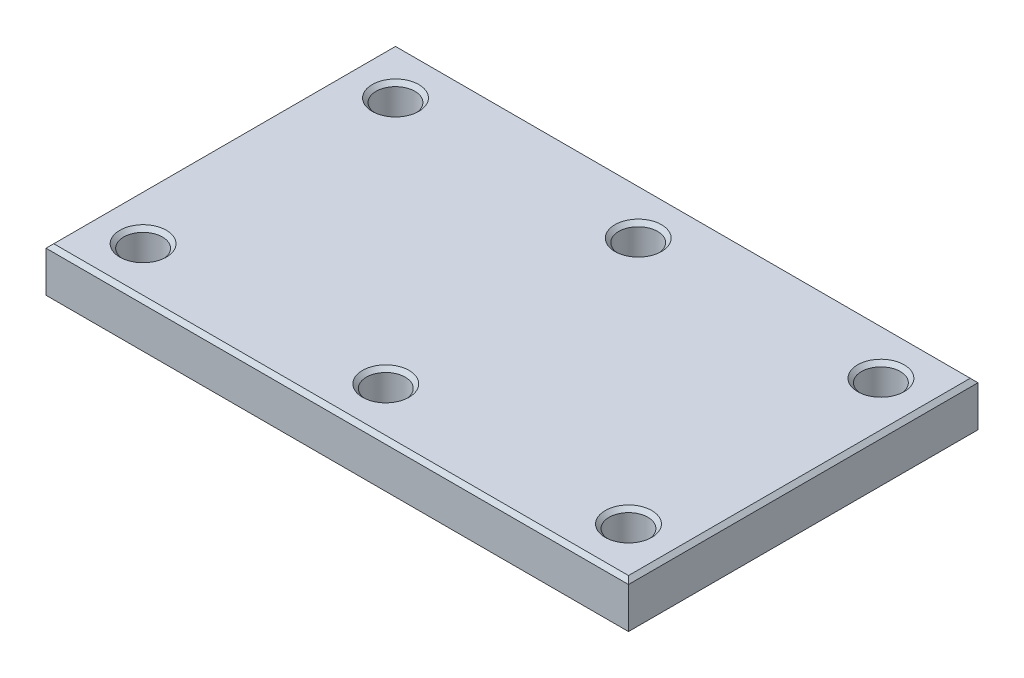
ISO-10303-21;
HEADER;
FILE_DESCRIPTION(('STEP AP214'),'2;1');
FILE_NAME('part.step','',(''),(''),'','','');
FILE_SCHEMA(('AUTOMOTIVE_DESIGN { 1 0 10303 214 1 1 1 1 }'));
ENDSEC;
DATA;
#1=APPLICATION_CONTEXT('core data for automotive mechanical design processes');
#2=APPLICATION_PROTOCOL_DEFINITION('international standard','automotive_design',2000,#1);
#3=PRODUCT_CONTEXT('',#1,'mechanical');
#4=PRODUCT('Part','Part','',(#3));
#5=PRODUCT_RELATED_PRODUCT_CATEGORY('part','',(#4));
#6=PRODUCT_DEFINITION_FORMATION('','',#4);
#7=PRODUCT_DEFINITION_CONTEXT('part definition',#1,'design');
#8=PRODUCT_DEFINITION('design','',#6,#7);
#9=PRODUCT_DEFINITION_SHAPE('','',#8);
#10=(LENGTH_UNIT() NAMED_UNIT(*) SI_UNIT(.MILLI.,.METRE.));
#11=(NAMED_UNIT(*) PLANE_ANGLE_UNIT() SI_UNIT($,.RADIAN.));
#12=(NAMED_UNIT(*) SI_UNIT($,.STERADIAN.) SOLID_ANGLE_UNIT());
#13=UNCERTAINTY_MEASURE_WITH_UNIT(LENGTH_MEASURE(1.E-05),#10,'distance_accuracy_value','');
#14=(GEOMETRIC_REPRESENTATION_CONTEXT(3) GLOBAL_UNCERTAINTY_ASSIGNED_CONTEXT((#13)) GLOBAL_UNIT_ASSIGNED_CONTEXT((#10,
#11,#12)) REPRESENTATION_CONTEXT('',''));
#15=CARTESIAN_POINT('',(0.,0.,0.));
#16=DIRECTION('',(0.,0.,1.));
#17=DIRECTION('',(1.,0.,0.));
#18=AXIS2_PLACEMENT_3D('',#15,#16,#17);
#19=CARTESIAN_POINT('',(150.,12.5,90.));
#20=DIRECTION('',(-1.,0.,0.));
#21=DIRECTION('',(0.,0.,1.));
#22=AXIS2_PLACEMENT_3D('',#19,#20,#21);
#23=PLANE('',#22);
#24=DIRECTION('',(0.,-1.,0.));
#25=VECTOR('',#24,1.);
#26=CARTESIAN_POINT('',(150.,12.5,90.));
#27=LINE('',#26,#25);
#28=CARTESIAN_POINT('',(150.,10.5,90.));
#29=VERTEX_POINT('',#28);
#30=CARTESIAN_POINT('',(150.,-10.5000000000001,90.));
#31=VERTEX_POINT('',#30);
#32=EDGE_CURVE('E165',#29,#31,#27,.T.);
#33=ORIENTED_EDGE('',*,*,#32,.T.);
#34=DIRECTION('',(0.,0.,-1.));
#35=VECTOR('',#34,1.);
#36=CARTESIAN_POINT('',(150.,-10.5000000000001,-90.));
#37=LINE('',#36,#35);
#38=CARTESIAN_POINT('',(150.,-10.5000000000001,-90.));
#39=VERTEX_POINT('',#38);
#40=EDGE_CURVE('E197',#31,#39,#37,.T.);
#41=ORIENTED_EDGE('',*,*,#40,.T.);
#42=DIRECTION('',(0.,-1.,0.));
#43=VECTOR('',#42,1.);
#44=CARTESIAN_POINT('',(150.,12.5,-90.));
#45=LINE('',#44,#43);
#46=CARTESIAN_POINT('',(150.,10.5,-90.));
#47=VERTEX_POINT('',#46);
#48=EDGE_CURVE('E247',#47,#39,#45,.T.);
#49=ORIENTED_EDGE('',*,*,#48,.F.);
#50=DIRECTION('',(0.,0.,1.));
#51=VECTOR('',#50,1.);
#52=CARTESIAN_POINT('',(150.,10.5,90.));
#53=LINE('',#52,#51);
#54=EDGE_CURVE('E139',#47,#29,#53,.T.);
#55=ORIENTED_EDGE('',*,*,#54,.T.);
#56=EDGE_LOOP('',(#33,#41,#49,#55));
#57=FACE_BOUND('',#56,.T.);
#58=ADVANCED_FACE('F33',(#57),#23,.F.);
#59=CARTESIAN_POINT('',(-150.,12.5,-90.));
#60=DIRECTION('',(0.,0.,1.));
#61=DIRECTION('',(1.,0.,0.));
#62=AXIS2_PLACEMENT_3D('',#59,#60,#61);
#63=PLANE('',#62);
#64=ORIENTED_EDGE('',*,*,#48,.T.);
#65=DIRECTION('',(-1.,0.,0.));
#66=VECTOR('',#65,1.);
#67=CARTESIAN_POINT('',(-150.,-10.5000000000001,-90.));
#68=LINE('',#67,#66);
#69=CARTESIAN_POINT('',(-150.,-10.5000000000001,-90.));
#70=VERTEX_POINT('',#69);
#71=EDGE_CURVE('E158',#39,#70,#68,.T.);
#72=ORIENTED_EDGE('',*,*,#71,.T.);
#73=DIRECTION('',(0.,-1.,0.));
#74=VECTOR('',#73,1.);
#75=CARTESIAN_POINT('',(-150.,12.5,-90.));
#76=LINE('',#75,#74);
#77=CARTESIAN_POINT('',(-150.,10.5,-90.));
#78=VERTEX_POINT('',#77);
#79=EDGE_CURVE('E244',#78,#70,#76,.T.);
#80=ORIENTED_EDGE('',*,*,#79,.F.);
#81=DIRECTION('',(1.,0.,0.));
#82=VECTOR('',#81,1.);
#83=CARTESIAN_POINT('',(-150.,10.5,-90.));
#84=LINE('',#83,#82);
#85=EDGE_CURVE('E137',#78,#47,#84,.T.);
#86=ORIENTED_EDGE('',*,*,#85,.T.);
#87=EDGE_LOOP('',(#64,#72,#80,#86));
#88=FACE_BOUND('',#87,.T.);
#89=ADVANCED_FACE('F243',(#88),#63,.F.);
#90=CARTESIAN_POINT('',(-150.,12.5,90.));
#91=DIRECTION('',(1.,0.,0.));
#92=DIRECTION('',(0.,0.,-1.));
#93=AXIS2_PLACEMENT_3D('',#90,#91,#92);
#94=PLANE('',#93);
#95=ORIENTED_EDGE('',*,*,#79,.T.);
#96=DIRECTION('',(0.,0.,1.));
#97=VECTOR('',#96,1.);
#98=CARTESIAN_POINT('',(-150.,-10.5000000000001,90.));
#99=LINE('',#98,#97);
#100=CARTESIAN_POINT('',(-150.,-10.5000000000001,90.));
#101=VERTEX_POINT('',#100);
#102=EDGE_CURVE('E58',#70,#101,#99,.T.);
#103=ORIENTED_EDGE('',*,*,#102,.T.);
#104=DIRECTION('',(0.,-1.,0.));
#105=VECTOR('',#104,1.);
#106=CARTESIAN_POINT('',(-150.,12.5,90.));
#107=LINE('',#106,#105);
#108=CARTESIAN_POINT('',(-150.,10.5,90.));
#109=VERTEX_POINT('',#108);
#110=EDGE_CURVE('E250',#109,#101,#107,.T.);
#111=ORIENTED_EDGE('',*,*,#110,.F.);
#112=DIRECTION('',(0.,0.,-1.));
#113=VECTOR('',#112,1.);
#114=CARTESIAN_POINT('',(-150.,10.5,90.));
#115=LINE('',#114,#113);
#116=EDGE_CURVE('E131',#109,#78,#115,.T.);
#117=ORIENTED_EDGE('',*,*,#116,.T.);
#118=EDGE_LOOP('',(#95,#103,#111,#117));
#119=FACE_BOUND('',#118,.T.);
#120=ADVANCED_FACE('F248',(#119),#94,.F.);
#121=CARTESIAN_POINT('',(-150.,12.5,90.));
#122=DIRECTION('',(0.,0.,-1.));
#123=DIRECTION('',(-1.,0.,0.));
#124=AXIS2_PLACEMENT_3D('',#121,#122,#123);
#125=PLANE('',#124);
#126=ORIENTED_EDGE('',*,*,#110,.T.);
#127=DIRECTION('',(1.,0.,0.));
#128=VECTOR('',#127,1.);
#129=CARTESIAN_POINT('',(150.,-10.5000000000001,90.));
#130=LINE('',#129,#128);
#131=EDGE_CURVE('E50',#101,#31,#130,.T.);
#132=ORIENTED_EDGE('',*,*,#131,.T.);
#133=ORIENTED_EDGE('',*,*,#32,.F.);
#134=DIRECTION('',(-1.,0.,0.));
#135=VECTOR('',#134,1.);
#136=CARTESIAN_POINT('',(-150.,10.5,90.));
#137=LINE('',#136,#135);
#138=EDGE_CURVE('E110',#29,#109,#137,.T.);
#139=ORIENTED_EDGE('',*,*,#138,.T.);
#140=EDGE_LOOP('',(#126,#132,#133,#139));
#141=FACE_BOUND('',#140,.T.);
#142=ADVANCED_FACE('F277',(#141),#125,.F.);
#143=CARTESIAN_POINT('',(0.,12.5,0.));
#144=DIRECTION('',(0.,-1.,0.));
#145=DIRECTION('',(0.,0.,-1.));
#146=AXIS2_PLACEMENT_3D('',#143,#144,#145);
#147=PLANE('',#146);
#148=DIRECTION('',(0.,0.,1.));
#149=VECTOR('',#148,1.);
#150=CARTESIAN_POINT('',(-148.,12.5,0.));
#151=LINE('',#150,#149);
#152=CARTESIAN_POINT('',(-148.,12.5,-88.));
#153=VERTEX_POINT('',#152);
#154=CARTESIAN_POINT('',(-148.,12.5,88.));
#155=VERTEX_POINT('',#154);
#156=EDGE_CURVE('E128',#153,#155,#151,.T.);
#157=ORIENTED_EDGE('',*,*,#156,.T.);
#158=DIRECTION('',(1.,0.,0.));
#159=VECTOR('',#158,1.);
#160=CARTESIAN_POINT('',(0.,12.5,88.));
#161=LINE('',#160,#159);
#162=CARTESIAN_POINT('',(148.,12.5,88.));
#163=VERTEX_POINT('',#162);
#164=EDGE_CURVE('E108',#155,#163,#161,.T.);
#165=ORIENTED_EDGE('',*,*,#164,.T.);
#166=DIRECTION('',(0.,0.,-1.));
#167=VECTOR('',#166,1.);
#168=CARTESIAN_POINT('',(148.,12.5,0.));
#169=LINE('',#168,#167);
#170=CARTESIAN_POINT('',(148.,12.5,-88.));
#171=VERTEX_POINT('',#170);
#172=EDGE_CURVE('E116',#163,#171,#169,.T.);
#173=ORIENTED_EDGE('',*,*,#172,.T.);
#174=DIRECTION('',(-1.,0.,0.));
#175=VECTOR('',#174,1.);
#176=CARTESIAN_POINT('',(0.,12.5,-88.));
#177=LINE('',#176,#175);
#178=EDGE_CURVE('E122',#171,#153,#177,.T.);
#179=ORIENTED_EDGE('',*,*,#178,.T.);
#180=EDGE_LOOP('',(#157,#165,#173,#179));
#181=FACE_BOUND('',#180,.T.);
#182=CARTESIAN_POINT('',(-125.,12.5,-65.));
#183=DIRECTION('',(0.,-1.,0.));
#184=DIRECTION('',(0.,0.,-1.));
#185=AXIS2_PLACEMENT_3D('',#182,#183,#184);
#186=CIRCLE('',#185,12.);
#187=CARTESIAN_POINT('',(-125.,12.5,-77.));
#188=VERTEX_POINT('',#187);
#189=EDGE_CURVE('E123',#188,#188,#186,.T.);
#190=ORIENTED_EDGE('',*,*,#189,.T.);
#191=EDGE_LOOP('',(#190));
#192=FACE_BOUND('',#191,.T.);
#193=CARTESIAN_POINT('',(-2.22044604925031E-13,12.5,-65.));
#194=DIRECTION('',(0.,-1.,0.));
#195=DIRECTION('',(0.,0.,-1.));
#196=AXIS2_PLACEMENT_3D('',#193,#194,#195);
#197=CIRCLE('',#196,12.);
#198=CARTESIAN_POINT('',(-2.22044604925031E-13,12.5,-77.));
#199=VERTEX_POINT('',#198);
#200=EDGE_CURVE('E268',#199,#199,#197,.T.);
#201=ORIENTED_EDGE('',*,*,#200,.T.);
#202=EDGE_LOOP('',(#201));
#203=FACE_BOUND('',#202,.T.);
#204=CARTESIAN_POINT('',(125.,12.5,-65.));
#205=DIRECTION('',(0.,-1.,0.));
#206=DIRECTION('',(0.,0.,-1.));
#207=AXIS2_PLACEMENT_3D('',#204,#205,#206);
#208=CIRCLE('',#207,12.);
#209=CARTESIAN_POINT('',(125.,12.5,-77.));
#210=VERTEX_POINT('',#209);
#211=EDGE_CURVE('E265',#210,#210,#208,.T.);
#212=ORIENTED_EDGE('',*,*,#211,.T.);
#213=EDGE_LOOP('',(#212));
#214=FACE_BOUND('',#213,.T.);
#215=CARTESIAN_POINT('',(1.13797860024079E-12,12.5,65.));
#216=DIRECTION('',(0.,-1.,0.));
#217=DIRECTION('',(0.,0.,-1.));
#218=AXIS2_PLACEMENT_3D('',#215,#216,#217);
#219=CIRCLE('',#218,12.);
#220=CARTESIAN_POINT('',(1.13797860024079E-12,12.5,53.));
#221=VERTEX_POINT('',#220);
#222=EDGE_CURVE('E262',#221,#221,#219,.T.);
#223=ORIENTED_EDGE('',*,*,#222,.T.);
#224=EDGE_LOOP('',(#223));
#225=FACE_BOUND('',#224,.T.);
#226=CARTESIAN_POINT('',(125.000000000001,12.5,65.));
#227=DIRECTION('',(0.,-1.,0.));
#228=DIRECTION('',(0.,0.,-1.));
#229=AXIS2_PLACEMENT_3D('',#226,#227,#228);
#230=CIRCLE('',#229,12.);
#231=CARTESIAN_POINT('',(125.000000000001,12.5,53.));
#232=VERTEX_POINT('',#231);
#233=EDGE_CURVE('E259',#232,#232,#230,.T.);
#234=ORIENTED_EDGE('',*,*,#233,.T.);
#235=EDGE_LOOP('',(#234));
#236=FACE_BOUND('',#235,.T.);
#237=CARTESIAN_POINT('',(-124.999999999999,12.5,65.));
#238=DIRECTION('',(0.,-1.,0.));
#239=DIRECTION('',(0.,0.,-1.));
#240=AXIS2_PLACEMENT_3D('',#237,#238,#239);
#241=CIRCLE('',#240,12.);
#242=CARTESIAN_POINT('',(-124.999999999999,12.5,53.));
#243=VERTEX_POINT('',#242);
#244=EDGE_CURVE('E252',#243,#243,#241,.T.);
#245=ORIENTED_EDGE('',*,*,#244,.T.);
#246=EDGE_LOOP('',(#245));
#247=FACE_BOUND('',#246,.T.);
#248=ADVANCED_FACE('F125',(#181,#192,#203,#214,#225,#236,#247),#147,.F.);
#249=CARTESIAN_POINT('',(0.,-12.5,0.));
#250=DIRECTION('',(0.,-1.,0.));
#251=DIRECTION('',(0.,0.,-1.));
#252=AXIS2_PLACEMENT_3D('',#249,#250,#251);
#253=PLANE('',#252);
#254=DIRECTION('',(0.,0.,-1.));
#255=VECTOR('',#254,1.);
#256=CARTESIAN_POINT('',(-148.,-12.5,-90.));
#257=LINE('',#256,#255);
#258=CARTESIAN_POINT('',(-148.,-12.5,88.));
#259=VERTEX_POINT('',#258);
#260=CARTESIAN_POINT('',(-148.,-12.5,-88.));
#261=VERTEX_POINT('',#260);
#262=EDGE_CURVE('E190',#259,#261,#257,.T.);
#263=ORIENTED_EDGE('',*,*,#262,.T.);
#264=DIRECTION('',(1.,0.,0.));
#265=VECTOR('',#264,1.);
#266=CARTESIAN_POINT('',(150.,-12.5,-88.));
#267=LINE('',#266,#265);
#268=CARTESIAN_POINT('',(148.,-12.5,-88.));
#269=VERTEX_POINT('',#268);
#270=EDGE_CURVE('E192',#261,#269,#267,.T.);
#271=ORIENTED_EDGE('',*,*,#270,.T.);
#272=DIRECTION('',(0.,0.,1.));
#273=VECTOR('',#272,1.);
#274=CARTESIAN_POINT('',(148.,-12.5,90.));
#275=LINE('',#274,#273);
#276=CARTESIAN_POINT('',(148.,-12.5,88.));
#277=VERTEX_POINT('',#276);
#278=EDGE_CURVE('E186',#269,#277,#275,.T.);
#279=ORIENTED_EDGE('',*,*,#278,.T.);
#280=DIRECTION('',(-1.,0.,0.));
#281=VECTOR('',#280,1.);
#282=CARTESIAN_POINT('',(-150.,-12.5,88.));
#283=LINE('',#282,#281);
#284=EDGE_CURVE('E188',#277,#259,#283,.T.);
#285=ORIENTED_EDGE('',*,*,#284,.T.);
#286=EDGE_LOOP('',(#263,#271,#279,#285));
#287=FACE_BOUND('',#286,.T.);
#288=CARTESIAN_POINT('',(-125.,-12.5,-65.));
#289=DIRECTION('',(0.,-1.,0.));
#290=DIRECTION('',(0.,0.,-1.));
#291=AXIS2_PLACEMENT_3D('',#288,#289,#290);
#292=CIRCLE('',#291,12.);
#293=CARTESIAN_POINT('',(-125.,-12.5,-77.));
#294=VERTEX_POINT('',#293);
#295=EDGE_CURVE('E183',#294,#294,#292,.F.);
#296=ORIENTED_EDGE('',*,*,#295,.T.);
#297=EDGE_LOOP('',(#296));
#298=FACE_BOUND('',#297,.T.);
#299=CARTESIAN_POINT('',(-2.22044604925031E-13,-12.5,-65.));
#300=DIRECTION('',(0.,-1.,0.));
#301=DIRECTION('',(0.,0.,-1.));
#302=AXIS2_PLACEMENT_3D('',#299,#300,#301);
#303=CIRCLE('',#302,12.);
#304=CARTESIAN_POINT('',(-2.22044604925031E-13,-12.5,-77.));
#305=VERTEX_POINT('',#304);
#306=EDGE_CURVE('E180',#305,#305,#303,.F.);
#307=ORIENTED_EDGE('',*,*,#306,.T.);
#308=EDGE_LOOP('',(#307));
#309=FACE_BOUND('',#308,.T.);
#310=CARTESIAN_POINT('',(125.,-12.5,-65.));
#311=DIRECTION('',(0.,-1.,0.));
#312=DIRECTION('',(0.,0.,-1.));
#313=AXIS2_PLACEMENT_3D('',#310,#311,#312);
#314=CIRCLE('',#313,11.9999999999999);
#315=CARTESIAN_POINT('',(125.,-12.5,-76.9999999999999));
#316=VERTEX_POINT('',#315);
#317=EDGE_CURVE('E177',#316,#316,#314,.F.);
#318=ORIENTED_EDGE('',*,*,#317,.T.);
#319=EDGE_LOOP('',(#318));
#320=FACE_BOUND('',#319,.T.);
#321=CARTESIAN_POINT('',(1.13797860024079E-12,-12.5,65.));
#322=DIRECTION('',(0.,-1.,0.));
#323=DIRECTION('',(0.,0.,-1.));
#324=AXIS2_PLACEMENT_3D('',#321,#322,#323);
#325=CIRCLE('',#324,12.);
#326=CARTESIAN_POINT('',(1.13797860024079E-12,-12.5,53.));
#327=VERTEX_POINT('',#326);
#328=EDGE_CURVE('E174',#327,#327,#325,.F.);
#329=ORIENTED_EDGE('',*,*,#328,.T.);
#330=EDGE_LOOP('',(#329));
#331=FACE_BOUND('',#330,.T.);
#332=CARTESIAN_POINT('',(125.000000000001,-12.5,65.));
#333=DIRECTION('',(0.,-1.,0.));
#334=DIRECTION('',(0.,0.,-1.));
#335=AXIS2_PLACEMENT_3D('',#332,#333,#334);
#336=CIRCLE('',#335,12.);
#337=CARTESIAN_POINT('',(125.000000000001,-12.5,53.));
#338=VERTEX_POINT('',#337);
#339=EDGE_CURVE('E171',#338,#338,#336,.F.);
#340=ORIENTED_EDGE('',*,*,#339,.T.);
#341=EDGE_LOOP('',(#340));
#342=FACE_BOUND('',#341,.T.);
#343=CARTESIAN_POINT('',(-124.999999999999,-12.5,65.));
#344=DIRECTION('',(0.,-1.,0.));
#345=DIRECTION('',(0.,0.,-1.));
#346=AXIS2_PLACEMENT_3D('',#343,#344,#345);
#347=CIRCLE('',#346,12.);
#348=CARTESIAN_POINT('',(-124.999999999999,-12.5,53.));
#349=VERTEX_POINT('',#348);
#350=EDGE_CURVE('E168',#349,#349,#347,.F.);
#351=ORIENTED_EDGE('',*,*,#350,.T.);
#352=EDGE_LOOP('',(#351));
#353=FACE_BOUND('',#352,.T.);
#354=ADVANCED_FACE('F232',(#287,#298,#309,#320,#331,#342,#353),#253,.T.);
#355=CARTESIAN_POINT('',(-125.,-12.5,-65.));
#356=DIRECTION('',(0.,1.,0.));
#357=DIRECTION('',(0.,0.,1.));
#358=AXIS2_PLACEMENT_3D('',#355,#356,#357);
#359=CYLINDRICAL_SURFACE('',#358,9.99999999999999);
#360=CARTESIAN_POINT('',(-125.,-10.4999999999999,-65.));
#361=DIRECTION('',(0.,-1.,0.));
#362=DIRECTION('',(0.,0.,-1.));
#363=AXIS2_PLACEMENT_3D('',#360,#361,#362);
#364=CIRCLE('',#363,9.99999999999999);
#365=CARTESIAN_POINT('',(-125.,-10.4999999999999,-75.));
#366=VERTEX_POINT('',#365);
#367=EDGE_CURVE('E199',#366,#366,#364,.T.);
#368=ORIENTED_EDGE('',*,*,#367,.T.);
#369=EDGE_LOOP('',(#368));
#370=FACE_BOUND('',#369,.T.);
#371=CARTESIAN_POINT('',(-125.,10.5,-65.));
#372=DIRECTION('',(0.,-1.,0.));
#373=DIRECTION('',(0.,0.,-1.));
#374=AXIS2_PLACEMENT_3D('',#371,#372,#373);
#375=CIRCLE('',#374,9.99999999999999);
#376=CARTESIAN_POINT('',(-125.,10.5,-75.));
#377=VERTEX_POINT('',#376);
#378=EDGE_CURVE('E141',#377,#377,#375,.F.);
#379=ORIENTED_EDGE('',*,*,#378,.T.);
#380=EDGE_LOOP('',(#379));
#381=FACE_BOUND('',#380,.T.);
#382=ADVANCED_FACE('F356',(#370,#381),#359,.F.);
#383=CARTESIAN_POINT('',(-2.22044604925031E-13,-12.5,-65.));
#384=DIRECTION('',(0.,1.,0.));
#385=DIRECTION('',(0.,0.,1.));
#386=AXIS2_PLACEMENT_3D('',#383,#384,#385);
#387=CYLINDRICAL_SURFACE('',#386,9.99999999999999);
#388=CARTESIAN_POINT('',(-2.22044604925031E-13,-10.4999999999999,-65.));
#389=DIRECTION('',(0.,-1.,0.));
#390=DIRECTION('',(0.,0.,-1.));
#391=AXIS2_PLACEMENT_3D('',#388,#389,#390);
#392=CIRCLE('',#391,9.99999999999999);
#393=CARTESIAN_POINT('',(-2.22044604925031E-13,-10.4999999999999,-75.));
#394=VERTEX_POINT('',#393);
#395=EDGE_CURVE('E202',#394,#394,#392,.T.);
#396=ORIENTED_EDGE('',*,*,#395,.T.);
#397=EDGE_LOOP('',(#396));
#398=FACE_BOUND('',#397,.T.);
#399=CARTESIAN_POINT('',(-2.22044604925031E-13,10.5,-65.));
#400=DIRECTION('',(0.,-1.,0.));
#401=DIRECTION('',(0.,0.,-1.));
#402=AXIS2_PLACEMENT_3D('',#399,#400,#401);
#403=CIRCLE('',#402,9.99999999999999);
#404=CARTESIAN_POINT('',(-2.22044604925031E-13,10.5,-75.));
#405=VERTEX_POINT('',#404);
#406=EDGE_CURVE('E144',#405,#405,#403,.F.);
#407=ORIENTED_EDGE('',*,*,#406,.T.);
#408=EDGE_LOOP('',(#407));
#409=FACE_BOUND('',#408,.T.);
#410=ADVANCED_FACE('F364',(#398,#409),#387,.F.);
#411=CARTESIAN_POINT('',(125.,-12.5,-65.));
#412=DIRECTION('',(0.,1.,0.));
#413=DIRECTION('',(0.,0.,1.));
#414=AXIS2_PLACEMENT_3D('',#411,#412,#413);
#415=CYLINDRICAL_SURFACE('',#414,9.99999999999998);
#416=CARTESIAN_POINT('',(125.,-10.5,-65.));
#417=DIRECTION('',(0.,-1.,0.));
#418=DIRECTION('',(0.,0.,-1.));
#419=AXIS2_PLACEMENT_3D('',#416,#417,#418);
#420=CIRCLE('',#419,9.99999999999998);
#421=CARTESIAN_POINT('',(125.,-10.5,-75.));
#422=VERTEX_POINT('',#421);
#423=EDGE_CURVE('E205',#422,#422,#420,.T.);
#424=ORIENTED_EDGE('',*,*,#423,.T.);
#425=EDGE_LOOP('',(#424));
#426=FACE_BOUND('',#425,.T.);
#427=CARTESIAN_POINT('',(125.,10.5,-65.));
#428=DIRECTION('',(0.,-1.,0.));
#429=DIRECTION('',(0.,0.,-1.));
#430=AXIS2_PLACEMENT_3D('',#427,#428,#429);
#431=CIRCLE('',#430,9.99999999999998);
#432=CARTESIAN_POINT('',(125.,10.5,-75.));
#433=VERTEX_POINT('',#432);
#434=EDGE_CURVE('E147',#433,#433,#431,.F.);
#435=ORIENTED_EDGE('',*,*,#434,.T.);
#436=EDGE_LOOP('',(#435));
#437=FACE_BOUND('',#436,.T.);
#438=ADVANCED_FACE('F543',(#426,#437),#415,.F.);
#439=CARTESIAN_POINT('',(1.13797860024079E-12,-12.5,65.));
#440=DIRECTION('',(0.,1.,0.));
#441=DIRECTION('',(0.,0.,1.));
#442=AXIS2_PLACEMENT_3D('',#439,#440,#441);
#443=CYLINDRICAL_SURFACE('',#442,9.99999999999999);
#444=CARTESIAN_POINT('',(1.13797860024079E-12,-10.5,65.));
#445=DIRECTION('',(0.,-1.,0.));
#446=DIRECTION('',(0.,0.,-1.));
#447=AXIS2_PLACEMENT_3D('',#444,#445,#446);
#448=CIRCLE('',#447,9.99999999999999);
#449=CARTESIAN_POINT('',(1.13797860024079E-12,-10.5,55.));
#450=VERTEX_POINT('',#449);
#451=EDGE_CURVE('E208',#450,#450,#448,.T.);
#452=ORIENTED_EDGE('',*,*,#451,.T.);
#453=EDGE_LOOP('',(#452));
#454=FACE_BOUND('',#453,.T.);
#455=CARTESIAN_POINT('',(1.13797860024079E-12,10.5,65.));
#456=DIRECTION('',(0.,-1.,0.));
#457=DIRECTION('',(0.,0.,-1.));
#458=AXIS2_PLACEMENT_3D('',#455,#456,#457);
#459=CIRCLE('',#458,9.99999999999999);
#460=CARTESIAN_POINT('',(1.13797860024079E-12,10.5,55.));
#461=VERTEX_POINT('',#460);
#462=EDGE_CURVE('E150',#461,#461,#459,.F.);
#463=ORIENTED_EDGE('',*,*,#462,.T.);
#464=EDGE_LOOP('',(#463));
#465=FACE_BOUND('',#464,.T.);
#466=ADVANCED_FACE('F533',(#454,#465),#443,.F.);
#467=CARTESIAN_POINT('',(125.000000000001,-12.5,65.));
#468=DIRECTION('',(0.,1.,0.));
#469=DIRECTION('',(0.,0.,1.));
#470=AXIS2_PLACEMENT_3D('',#467,#468,#469);
#471=CYLINDRICAL_SURFACE('',#470,9.99999999999998);
#472=CARTESIAN_POINT('',(125.000000000001,-10.5,65.));
#473=DIRECTION('',(0.,-1.,0.));
#474=DIRECTION('',(0.,0.,-1.));
#475=AXIS2_PLACEMENT_3D('',#472,#473,#474);
#476=CIRCLE('',#475,9.99999999999998);
#477=CARTESIAN_POINT('',(125.000000000001,-10.5,55.));
#478=VERTEX_POINT('',#477);
#479=EDGE_CURVE('E42',#478,#478,#476,.T.);
#480=ORIENTED_EDGE('',*,*,#479,.T.);
#481=EDGE_LOOP('',(#480));
#482=FACE_BOUND('',#481,.T.);
#483=CARTESIAN_POINT('',(125.000000000001,10.5,65.));
#484=DIRECTION('',(0.,-1.,0.));
#485=DIRECTION('',(0.,0.,-1.));
#486=AXIS2_PLACEMENT_3D('',#483,#484,#485);
#487=CIRCLE('',#486,9.99999999999998);
#488=CARTESIAN_POINT('',(125.000000000001,10.5,55.));
#489=VERTEX_POINT('',#488);
#490=EDGE_CURVE('E153',#489,#489,#487,.F.);
#491=ORIENTED_EDGE('',*,*,#490,.T.);
#492=EDGE_LOOP('',(#491));
#493=FACE_BOUND('',#492,.T.);
#494=ADVANCED_FACE('F523',(#482,#493),#471,.F.);
#495=CARTESIAN_POINT('',(-124.999999999999,-12.5,65.));
#496=DIRECTION('',(0.,1.,0.));
#497=DIRECTION('',(0.,0.,1.));
#498=AXIS2_PLACEMENT_3D('',#495,#496,#497);
#499=CYLINDRICAL_SURFACE('',#498,9.99999999999999);
#500=CARTESIAN_POINT('',(-124.999999999999,-10.5,65.));
#501=DIRECTION('',(0.,-1.,0.));
#502=DIRECTION('',(0.,0.,-1.));
#503=AXIS2_PLACEMENT_3D('',#500,#501,#502);
#504=CIRCLE('',#503,9.99999999999999);
#505=CARTESIAN_POINT('',(-124.999999999999,-10.5,55.));
#506=VERTEX_POINT('',#505);
#507=EDGE_CURVE('E11',#506,#506,#504,.T.);
#508=ORIENTED_EDGE('',*,*,#507,.T.);
#509=EDGE_LOOP('',(#508));
#510=FACE_BOUND('',#509,.T.);
#511=CARTESIAN_POINT('',(-124.999999999999,10.5,65.));
#512=DIRECTION('',(0.,-1.,0.));
#513=DIRECTION('',(0.,0.,-1.));
#514=AXIS2_PLACEMENT_3D('',#511,#512,#513);
#515=CIRCLE('',#514,9.99999999999999);
#516=CARTESIAN_POINT('',(-124.999999999999,10.5,55.));
#517=VERTEX_POINT('',#516);
#518=EDGE_CURVE('E156',#517,#517,#515,.F.);
#519=ORIENTED_EDGE('',*,*,#518,.T.);
#520=EDGE_LOOP('',(#519));
#521=FACE_BOUND('',#520,.T.);
#522=ADVANCED_FACE('F296',(#510,#521),#499,.F.);
#523=CARTESIAN_POINT('',(0.,12.5,-88.));
#524=DIRECTION('',(0.,-0.707106781186539,0.707106781186556));
#525=DIRECTION('',(-1.,0.,0.));
#526=AXIS2_PLACEMENT_3D('',#523,#524,#525);
#527=PLANE('',#526);
#528=DIRECTION('',(-0.577350269189617,0.577350269189637,0.577350269189623));
#529=VECTOR('',#528,1.);
#530=CARTESIAN_POINT('',(118.666666666667,41.8333333333338,-58.666666666667));
#531=LINE('',#530,#529);
#532=EDGE_CURVE('E119',#47,#171,#531,.T.);
#533=ORIENTED_EDGE('',*,*,#532,.F.);
#534=ORIENTED_EDGE('',*,*,#85,.F.);
#535=DIRECTION('',(0.577350269189625,0.577350269189633,0.577350269189619));
#536=VECTOR('',#535,1.);
#537=CARTESIAN_POINT('',(-98.6666666666668,61.8333333333339,-38.6666666666673));
#538=LINE('',#537,#536);
#539=EDGE_CURVE('E162',#153,#78,#538,.F.);
#540=ORIENTED_EDGE('',*,*,#539,.F.);
#541=ORIENTED_EDGE('',*,*,#178,.F.);
#542=EDGE_LOOP('',(#533,#534,#540,#541));
#543=FACE_BOUND('',#542,.T.);
#544=ADVANCED_FACE('F274',(#543),#527,.F.);
#545=CARTESIAN_POINT('',(-148.,12.5,0.));
#546=DIRECTION('',(0.707106781186552,-0.707106781186543,0.));
#547=DIRECTION('',(0.,0.,1.));
#548=AXIS2_PLACEMENT_3D('',#545,#546,#547);
#549=PLANE('',#548);
#550=ORIENTED_EDGE('',*,*,#539,.T.);
#551=ORIENTED_EDGE('',*,*,#116,.F.);
#552=DIRECTION('',(0.577350269189621,0.577350269189629,-0.577350269189627));
#553=VECTOR('',#552,1.);
#554=CARTESIAN_POINT('',(-118.666666666667,41.8333333333336,58.6666666666666));
#555=LINE('',#554,#553);
#556=EDGE_CURVE('E113',#155,#109,#555,.F.);
#557=ORIENTED_EDGE('',*,*,#556,.F.);
#558=ORIENTED_EDGE('',*,*,#156,.F.);
#559=EDGE_LOOP('',(#550,#551,#557,#558));
#560=FACE_BOUND('',#559,.T.);
#561=ADVANCED_FACE('F276',(#560),#549,.F.);
#562=CARTESIAN_POINT('',(148.,12.5,0.));
#563=DIRECTION('',(-0.70710678118656,-0.707106781186535,0.));
#564=DIRECTION('',(0.,0.,-1.));
#565=AXIS2_PLACEMENT_3D('',#562,#563,#564);
#566=PLANE('',#565);
#567=ORIENTED_EDGE('',*,*,#532,.T.);
#568=ORIENTED_EDGE('',*,*,#172,.F.);
#569=DIRECTION('',(0.577350269189613,-0.577350269189633,0.577350269189631));
#570=VECTOR('',#569,1.);
#571=CARTESIAN_POINT('',(118.666666666667,41.833333333334,58.6666666666661));
#572=LINE('',#571,#570);
#573=EDGE_CURVE('E104',#29,#163,#572,.F.);
#574=ORIENTED_EDGE('',*,*,#573,.F.);
#575=ORIENTED_EDGE('',*,*,#54,.F.);
#576=EDGE_LOOP('',(#567,#568,#574,#575));
#577=FACE_BOUND('',#576,.T.);
#578=ADVANCED_FACE('F117',(#577),#566,.F.);
#579=CARTESIAN_POINT('',(0.,12.5,88.));
#580=DIRECTION('',(0.,-0.707106781186546,-0.707106781186549));
#581=DIRECTION('',(1.,0.,0.));
#582=AXIS2_PLACEMENT_3D('',#579,#580,#581);
#583=PLANE('',#582);
#584=ORIENTED_EDGE('',*,*,#556,.T.);
#585=ORIENTED_EDGE('',*,*,#138,.F.);
#586=ORIENTED_EDGE('',*,*,#573,.T.);
#587=ORIENTED_EDGE('',*,*,#164,.F.);
#588=EDGE_LOOP('',(#584,#585,#586,#587));
#589=FACE_BOUND('',#588,.T.);
#590=ADVANCED_FACE('F106',(#589),#583,.F.);
#591=CARTESIAN_POINT('',(-125.,10.5,-65.));
#592=DIRECTION('',(0.,1.,0.));
#593=DIRECTION('',(0.,0.,1.));
#594=AXIS2_PLACEMENT_3D('',#591,#592,#593);
#595=CONICAL_SURFACE('',#594,9.99999999999999,0.785398163397447);
#596=ORIENTED_EDGE('',*,*,#189,.F.);
#597=EDGE_LOOP('',(#596));
#598=FACE_BOUND('',#597,.T.);
#599=ORIENTED_EDGE('',*,*,#378,.F.);
#600=EDGE_LOOP('',(#599));
#601=FACE_BOUND('',#600,.T.);
#602=ADVANCED_FACE('F289',(#598,#601),#595,.F.);
#603=CARTESIAN_POINT('',(-2.22044604925031E-13,10.5,-65.));
#604=DIRECTION('',(0.,1.,0.));
#605=DIRECTION('',(0.,0.,1.));
#606=AXIS2_PLACEMENT_3D('',#603,#604,#605);
#607=CONICAL_SURFACE('',#606,9.99999999999999,0.785398163397447);
#608=ORIENTED_EDGE('',*,*,#200,.F.);
#609=EDGE_LOOP('',(#608));
#610=FACE_BOUND('',#609,.T.);
#611=ORIENTED_EDGE('',*,*,#406,.F.);
#612=EDGE_LOOP('',(#611));
#613=FACE_BOUND('',#612,.T.);
#614=ADVANCED_FACE('F299',(#610,#613),#607,.F.);
#615=CARTESIAN_POINT('',(125.,10.5,-65.));
#616=DIRECTION('',(0.,1.,0.));
#617=DIRECTION('',(0.,0.,1.));
#618=AXIS2_PLACEMENT_3D('',#615,#616,#617);
#619=CONICAL_SURFACE('',#618,9.99999999999998,0.785398163397447);
#620=ORIENTED_EDGE('',*,*,#211,.F.);
#621=EDGE_LOOP('',(#620));
#622=FACE_BOUND('',#621,.T.);
#623=ORIENTED_EDGE('',*,*,#434,.F.);
#624=EDGE_LOOP('',(#623));
#625=FACE_BOUND('',#624,.T.);
#626=ADVANCED_FACE('F303',(#622,#625),#619,.F.);
#627=CARTESIAN_POINT('',(1.13797860024079E-12,10.5,65.));
#628=DIRECTION('',(0.,1.,0.));
#629=DIRECTION('',(0.,0.,1.));
#630=AXIS2_PLACEMENT_3D('',#627,#628,#629);
#631=CONICAL_SURFACE('',#630,9.99999999999999,0.785398163397447);
#632=ORIENTED_EDGE('',*,*,#222,.F.);
#633=EDGE_LOOP('',(#632));
#634=FACE_BOUND('',#633,.T.);
#635=ORIENTED_EDGE('',*,*,#462,.F.);
#636=EDGE_LOOP('',(#635));
#637=FACE_BOUND('',#636,.T.);
#638=ADVANCED_FACE('F307',(#634,#637),#631,.F.);
#639=CARTESIAN_POINT('',(125.000000000001,10.5,65.));
#640=DIRECTION('',(0.,1.,0.));
#641=DIRECTION('',(0.,0.,1.));
#642=AXIS2_PLACEMENT_3D('',#639,#640,#641);
#643=CONICAL_SURFACE('',#642,9.99999999999998,0.785398163397447);
#644=ORIENTED_EDGE('',*,*,#233,.F.);
#645=EDGE_LOOP('',(#644));
#646=FACE_BOUND('',#645,.T.);
#647=ORIENTED_EDGE('',*,*,#490,.F.);
#648=EDGE_LOOP('',(#647));
#649=FACE_BOUND('',#648,.T.);
#650=ADVANCED_FACE('F311',(#646,#649),#643,.F.);
#651=CARTESIAN_POINT('',(-124.999999999999,10.5,65.));
#652=DIRECTION('',(0.,1.,0.));
#653=DIRECTION('',(0.,0.,1.));
#654=AXIS2_PLACEMENT_3D('',#651,#652,#653);
#655=CONICAL_SURFACE('',#654,9.99999999999999,0.785398163397447);
#656=ORIENTED_EDGE('',*,*,#244,.F.);
#657=EDGE_LOOP('',(#656));
#658=FACE_BOUND('',#657,.T.);
#659=ORIENTED_EDGE('',*,*,#518,.F.);
#660=EDGE_LOOP('',(#659));
#661=FACE_BOUND('',#660,.T.);
#662=ADVANCED_FACE('F315',(#658,#661),#655,.F.);
#663=CARTESIAN_POINT('',(-150.,-10.5000000000001,90.));
#664=DIRECTION('',(0.,-0.707106781186556,0.707106781186539));
#665=DIRECTION('',(-1.,0.,0.));
#666=AXIS2_PLACEMENT_3D('',#663,#664,#665);
#667=PLANE('',#666);
#668=DIRECTION('',(0.577350269189626,-0.577350269189618,-0.577350269189633));
#669=VECTOR('',#668,1.);
#670=CARTESIAN_POINT('',(-150.,-10.5000000000001,90.));
#671=LINE('',#670,#669);
#672=EDGE_CURVE('E216',#259,#101,#671,.F.);
#673=ORIENTED_EDGE('',*,*,#672,.F.);
#674=ORIENTED_EDGE('',*,*,#284,.F.);
#675=DIRECTION('',(-0.577350269189619,-0.577350269189622,-0.577350269189637));
#676=VECTOR('',#675,1.);
#677=CARTESIAN_POINT('',(150.,-10.5000000000001,90.));
#678=LINE('',#677,#676);
#679=EDGE_CURVE('E37',#31,#277,#678,.T.);
#680=ORIENTED_EDGE('',*,*,#679,.F.);
#681=ORIENTED_EDGE('',*,*,#131,.F.);
#682=EDGE_LOOP('',(#673,#674,#680,#681));
#683=FACE_BOUND('',#682,.T.);
#684=ADVANCED_FACE('F230',(#683),#667,.T.);
#685=CARTESIAN_POINT('',(150.,-10.5000000000001,90.));
#686=DIRECTION('',(0.70710678118655,-0.707106781186545,0.));
#687=DIRECTION('',(0.,0.,1.));
#688=AXIS2_PLACEMENT_3D('',#685,#686,#687);
#689=PLANE('',#688);
#690=ORIENTED_EDGE('',*,*,#679,.T.);
#691=ORIENTED_EDGE('',*,*,#278,.F.);
#692=DIRECTION('',(0.577350269189622,0.577350269189626,-0.577350269189629));
#693=VECTOR('',#692,1.);
#694=CARTESIAN_POINT('',(90.,-70.5000000000004,-29.9999999999994));
#695=LINE('',#694,#693);
#696=EDGE_CURVE('E215',#39,#269,#695,.F.);
#697=ORIENTED_EDGE('',*,*,#696,.F.);
#698=ORIENTED_EDGE('',*,*,#40,.F.);
#699=EDGE_LOOP('',(#690,#691,#697,#698));
#700=FACE_BOUND('',#699,.T.);
#701=ADVANCED_FACE('F226',(#700),#689,.T.);
#702=CARTESIAN_POINT('',(-150.,-10.5000000000001,90.));
#703=DIRECTION('',(-0.707106781186543,-0.707106781186552,0.));
#704=DIRECTION('',(0.,0.,-1.));
#705=AXIS2_PLACEMENT_3D('',#702,#703,#704);
#706=PLANE('',#705);
#707=ORIENTED_EDGE('',*,*,#672,.T.);
#708=ORIENTED_EDGE('',*,*,#102,.F.);
#709=DIRECTION('',(0.57735026918963,-0.577350269189622,0.577350269189625));
#710=VECTOR('',#709,1.);
#711=CARTESIAN_POINT('',(-89.9999999999996,-70.4999999999996,-30.0000000000002));
#712=LINE('',#711,#710);
#713=EDGE_CURVE('E213',#261,#70,#712,.F.);
#714=ORIENTED_EDGE('',*,*,#713,.F.);
#715=ORIENTED_EDGE('',*,*,#262,.F.);
#716=EDGE_LOOP('',(#707,#708,#714,#715));
#717=FACE_BOUND('',#716,.T.);
#718=ADVANCED_FACE('F239',(#717),#706,.T.);
#719=CARTESIAN_POINT('',(-150.,-10.5000000000001,-90.));
#720=DIRECTION('',(0.,-0.707106781186549,-0.707106781186546));
#721=DIRECTION('',(1.,0.,0.));
#722=AXIS2_PLACEMENT_3D('',#719,#720,#721);
#723=PLANE('',#722);
#724=ORIENTED_EDGE('',*,*,#696,.T.);
#725=ORIENTED_EDGE('',*,*,#270,.F.);
#726=ORIENTED_EDGE('',*,*,#713,.T.);
#727=ORIENTED_EDGE('',*,*,#71,.F.);
#728=EDGE_LOOP('',(#724,#725,#726,#727));
#729=FACE_BOUND('',#728,.T.);
#730=ADVANCED_FACE('F237',(#729),#723,.T.);
#731=CARTESIAN_POINT('',(-125.,-12.5,-65.));
#732=DIRECTION('',(0.,-1.,0.));
#733=DIRECTION('',(0.,0.,-1.));
#734=AXIS2_PLACEMENT_3D('',#731,#732,#733);
#735=CONICAL_SURFACE('',#734,12.,0.78539816339744);
#736=ORIENTED_EDGE('',*,*,#367,.F.);
#737=EDGE_LOOP('',(#736));
#738=FACE_BOUND('',#737,.T.);
#739=ORIENTED_EDGE('',*,*,#295,.F.);
#740=EDGE_LOOP('',(#739));
#741=FACE_BOUND('',#740,.T.);
#742=ADVANCED_FACE('F322',(#738,#741),#735,.F.);
#743=CARTESIAN_POINT('',(-2.22044604925031E-13,-12.5,-65.));
#744=DIRECTION('',(0.,-1.,0.));
#745=DIRECTION('',(0.,0.,-1.));
#746=AXIS2_PLACEMENT_3D('',#743,#744,#745);
#747=CONICAL_SURFACE('',#746,12.,0.78539816339744);
#748=ORIENTED_EDGE('',*,*,#395,.F.);
#749=EDGE_LOOP('',(#748));
#750=FACE_BOUND('',#749,.T.);
#751=ORIENTED_EDGE('',*,*,#306,.F.);
#752=EDGE_LOOP('',(#751));
#753=FACE_BOUND('',#752,.T.);
#754=ADVANCED_FACE('F331',(#750,#753),#747,.F.);
#755=CARTESIAN_POINT('',(125.,-12.5,-65.));
#756=DIRECTION('',(0.,-1.,0.));
#757=DIRECTION('',(0.,0.,-1.));
#758=AXIS2_PLACEMENT_3D('',#755,#756,#757);
#759=CONICAL_SURFACE('',#758,11.9999999999999,0.78539816339744);
#760=ORIENTED_EDGE('',*,*,#423,.F.);
#761=EDGE_LOOP('',(#760));
#762=FACE_BOUND('',#761,.T.);
#763=ORIENTED_EDGE('',*,*,#317,.F.);
#764=EDGE_LOOP('',(#763));
#765=FACE_BOUND('',#764,.T.);
#766=ADVANCED_FACE('F335',(#762,#765),#759,.F.);
#767=CARTESIAN_POINT('',(1.13797860024079E-12,-12.5,65.));
#768=DIRECTION('',(0.,-1.,0.));
#769=DIRECTION('',(0.,0.,-1.));
#770=AXIS2_PLACEMENT_3D('',#767,#768,#769);
#771=CONICAL_SURFACE('',#770,12.,0.785398163397443);
#772=ORIENTED_EDGE('',*,*,#451,.F.);
#773=EDGE_LOOP('',(#772));
#774=FACE_BOUND('',#773,.T.);
#775=ORIENTED_EDGE('',*,*,#328,.F.);
#776=EDGE_LOOP('',(#775));
#777=FACE_BOUND('',#776,.T.);
#778=ADVANCED_FACE('F339',(#774,#777),#771,.F.);
#779=CARTESIAN_POINT('',(125.000000000001,-12.5,65.));
#780=DIRECTION('',(0.,-1.,0.));
#781=DIRECTION('',(0.,0.,-1.));
#782=AXIS2_PLACEMENT_3D('',#779,#780,#781);
#783=CONICAL_SURFACE('',#782,12.,0.785398163397443);
#784=ORIENTED_EDGE('',*,*,#479,.F.);
#785=EDGE_LOOP('',(#784));
#786=FACE_BOUND('',#785,.T.);
#787=ORIENTED_EDGE('',*,*,#339,.F.);
#788=EDGE_LOOP('',(#787));
#789=FACE_BOUND('',#788,.T.);
#790=ADVANCED_FACE('F342',(#786,#789),#783,.F.);
#791=CARTESIAN_POINT('',(-124.999999999999,-12.5,65.));
#792=DIRECTION('',(0.,-1.,0.));
#793=DIRECTION('',(0.,0.,-1.));
#794=AXIS2_PLACEMENT_3D('',#791,#792,#793);
#795=CONICAL_SURFACE('',#794,12.,0.785398163397443);
#796=ORIENTED_EDGE('',*,*,#507,.F.);
#797=EDGE_LOOP('',(#796));
#798=FACE_BOUND('',#797,.T.);
#799=ORIENTED_EDGE('',*,*,#350,.F.);
#800=EDGE_LOOP('',(#799));
#801=FACE_BOUND('',#800,.T.);
#802=ADVANCED_FACE('F35',(#798,#801),#795,.F.);
#803=CLOSED_SHELL('',(#58,#89,#120,#142,#248,#354,#382,#410,#438,#466,#494,#522,#544,#561,#578,
#590,#602,#614,#626,#638,#650,#662,#684,#701,#718,#730,#742,#754,#766,#778,#790,#802));
#804=MANIFOLD_SOLID_BREP('B2',#803);
#805=ADVANCED_BREP_SHAPE_REPRESENTATION('',(#18,#804),#14);
#806=SHAPE_DEFINITION_REPRESENTATION(#9,#805);
ENDSEC;
END-ISO-10303-21;
